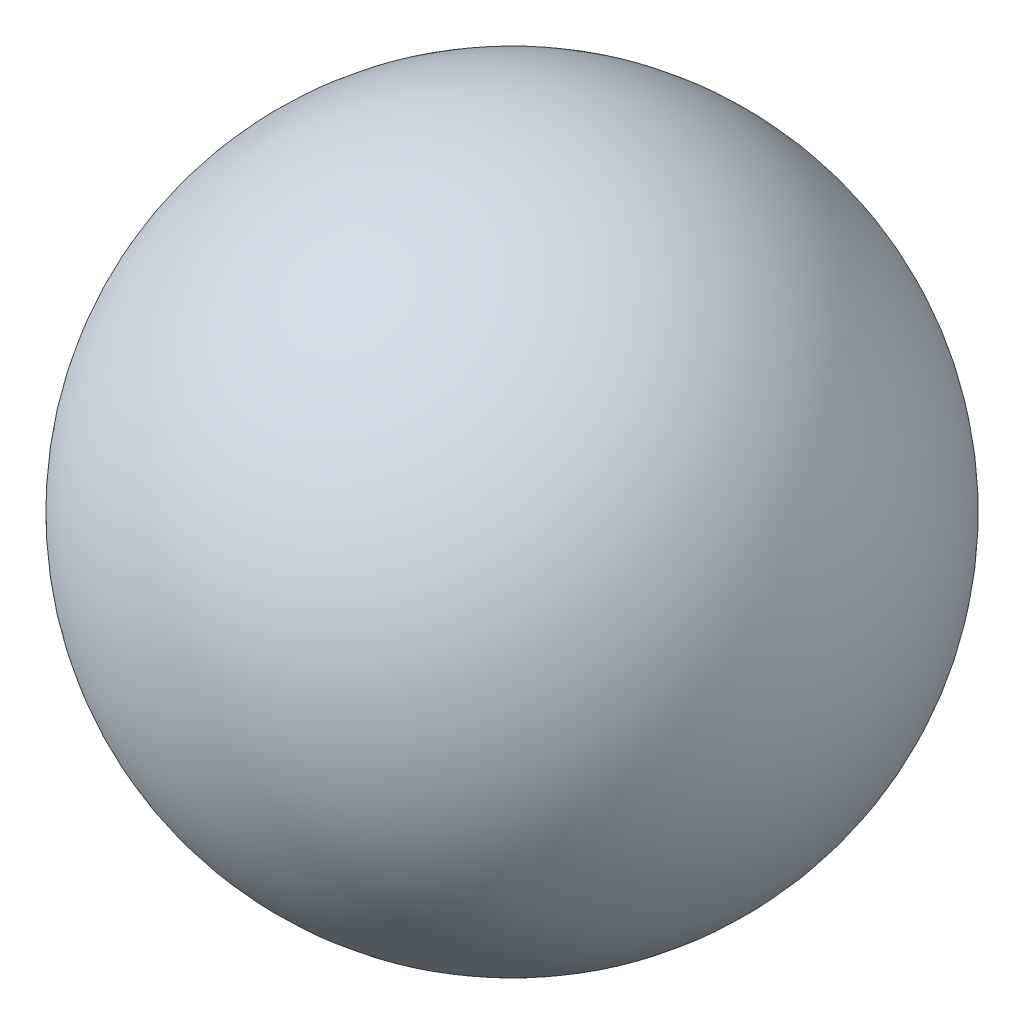
ISO-10303-21;
HEADER;
FILE_DESCRIPTION(('STEP AP214'),'2;1');
FILE_NAME('part.step','',(''),(''),'','','');
FILE_SCHEMA(('AUTOMOTIVE_DESIGN { 1 0 10303 214 1 1 1 1 }'));
ENDSEC;
DATA;
#1=APPLICATION_CONTEXT('core data for automotive mechanical design processes');
#2=APPLICATION_PROTOCOL_DEFINITION('international standard','automotive_design',2000,#1);
#3=PRODUCT_CONTEXT('',#1,'mechanical');
#4=PRODUCT('Part','Part','',(#3));
#5=PRODUCT_RELATED_PRODUCT_CATEGORY('part','',(#4));
#6=PRODUCT_DEFINITION_FORMATION('','',#4);
#7=PRODUCT_DEFINITION_CONTEXT('part definition',#1,'design');
#8=PRODUCT_DEFINITION('design','',#6,#7);
#9=PRODUCT_DEFINITION_SHAPE('','',#8);
#10=(LENGTH_UNIT() NAMED_UNIT(*) SI_UNIT(.MILLI.,.METRE.));
#11=(NAMED_UNIT(*) PLANE_ANGLE_UNIT() SI_UNIT($,.RADIAN.));
#12=(NAMED_UNIT(*) SI_UNIT($,.STERADIAN.) SOLID_ANGLE_UNIT());
#13=UNCERTAINTY_MEASURE_WITH_UNIT(LENGTH_MEASURE(1.E-05),#10,'distance_accuracy_value','');
#14=(GEOMETRIC_REPRESENTATION_CONTEXT(3) GLOBAL_UNCERTAINTY_ASSIGNED_CONTEXT((#13)) GLOBAL_UNIT_ASSIGNED_CONTEXT((#10,
#11,#12)) REPRESENTATION_CONTEXT('',''));
#15=CARTESIAN_POINT('',(0.,0.,0.));
#16=DIRECTION('',(0.,0.,1.));
#17=DIRECTION('',(1.,0.,0.));
#18=AXIS2_PLACEMENT_3D('',#15,#16,#17);
#19=CARTESIAN_POINT('',(2.5,9.75,0.));
#20=DIRECTION('',(0.,-1.,0.));
#21=DIRECTION('',(0.,0.,-1.));
#22=AXIS2_PLACEMENT_3D('',#19,#20,#21);
#23=SPHERICAL_SURFACE('',#22,1.1905);
#24=CARTESIAN_POINT('',(2.5,10.9405,0.));
#25=VERTEX_POINT('',#24);
#26=VERTEX_LOOP('',#25);
#27=FACE_BOUND('',#26,.T.);
#28=CARTESIAN_POINT('',(2.5,8.5595,0.));
#29=VERTEX_POINT('',#28);
#30=VERTEX_LOOP('',#29);
#31=FACE_BOUND('',#30,.T.);
#32=ADVANCED_FACE('F15',(#27,#31),#23,.T.);
#33=CLOSED_SHELL('',(#32));
#34=MANIFOLD_SOLID_BREP('B1',#33);
#35=ADVANCED_BREP_SHAPE_REPRESENTATION('',(#18,#34),#14);
#36=SHAPE_DEFINITION_REPRESENTATION(#9,#35);
ENDSEC;
END-ISO-10303-21;
